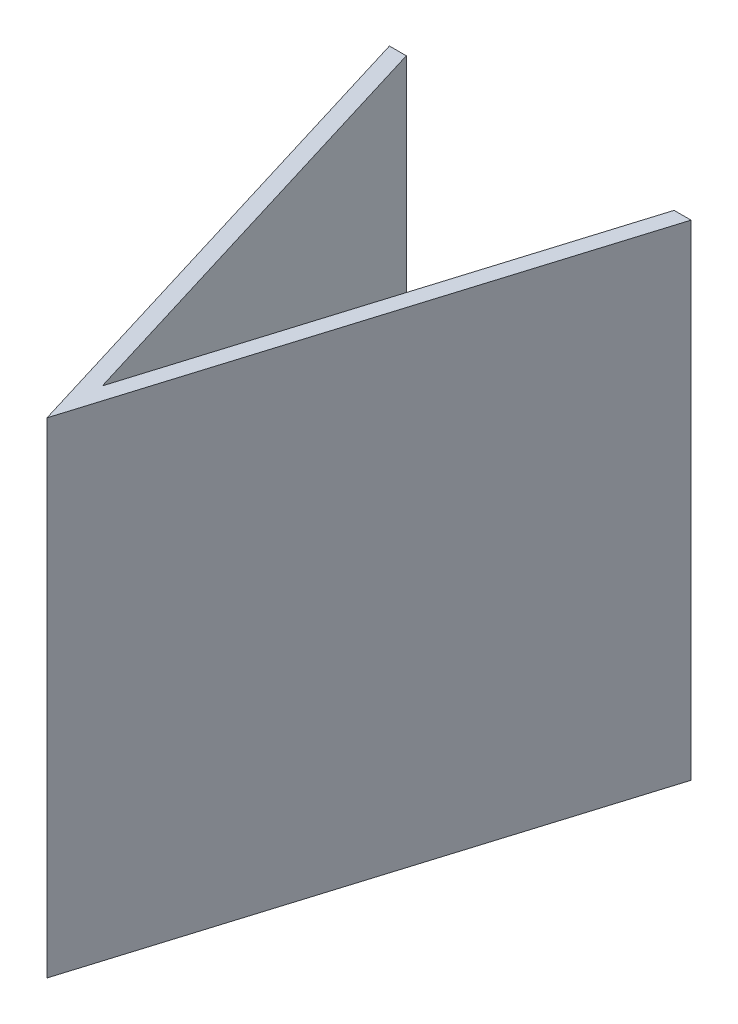
ISO-10303-21;
HEADER;
FILE_DESCRIPTION(('STEP AP214'),'2;1');
FILE_NAME('part.step','',(''),(''),'','','');
FILE_SCHEMA(('AUTOMOTIVE_DESIGN { 1 0 10303 214 1 1 1 1 }'));
ENDSEC;
DATA;
#1=APPLICATION_CONTEXT('core data for automotive mechanical design processes');
#2=APPLICATION_PROTOCOL_DEFINITION('international standard','automotive_design',2000,#1);
#3=PRODUCT_CONTEXT('',#1,'mechanical');
#4=PRODUCT('Part','Part','',(#3));
#5=PRODUCT_RELATED_PRODUCT_CATEGORY('part','',(#4));
#6=PRODUCT_DEFINITION_FORMATION('','',#4);
#7=PRODUCT_DEFINITION_CONTEXT('part definition',#1,'design');
#8=PRODUCT_DEFINITION('design','',#6,#7);
#9=PRODUCT_DEFINITION_SHAPE('','',#8);
#10=(LENGTH_UNIT() NAMED_UNIT(*) SI_UNIT(.MILLI.,.METRE.));
#11=(NAMED_UNIT(*) PLANE_ANGLE_UNIT() SI_UNIT($,.RADIAN.));
#12=(NAMED_UNIT(*) SI_UNIT($,.STERADIAN.) SOLID_ANGLE_UNIT());
#13=UNCERTAINTY_MEASURE_WITH_UNIT(LENGTH_MEASURE(1.E-05),#10,'distance_accuracy_value','');
#14=(GEOMETRIC_REPRESENTATION_CONTEXT(3) GLOBAL_UNCERTAINTY_ASSIGNED_CONTEXT((#13)) GLOBAL_UNIT_ASSIGNED_CONTEXT((#10,
#11,#12)) REPRESENTATION_CONTEXT('',''));
#15=CARTESIAN_POINT('',(0.,0.,0.));
#16=DIRECTION('',(0.,0.,1.));
#17=DIRECTION('',(1.,0.,0.));
#18=AXIS2_PLACEMENT_3D('',#15,#16,#17);
#19=CARTESIAN_POINT('',(-4.15957630186494,-2.51,4.56537000902889));
#20=DIRECTION('',(0.956304755963033,0.,-0.292371704722745));
#21=DIRECTION('',(-0.292371704722745,0.,-0.956304755963033));
#22=AXIS2_PLACEMENT_3D('',#19,#20,#21);
#23=PLANE('',#22);
#24=DIRECTION('',(0.,1.,0.));
#25=VECTOR('',#24,1.);
#26=CARTESIAN_POINT('',(-0.0200292878637983,-2.51,18.1052181991123));
#27=LINE('',#26,#25);
#28=CARTESIAN_POINT('',(-0.0200292878638,-2.5,18.1052181991123));
#29=VERTEX_POINT('',#28);
#30=CARTESIAN_POINT('',(-0.0200292878638,12.5,18.1052181991123));
#31=VERTEX_POINT('',#30);
#32=EDGE_CURVE('E11',#29,#31,#27,.T.);
#33=ORIENTED_EDGE('',*,*,#32,.F.);
#34=DIRECTION('',(-0.292371704722745,0.,-0.956304755963033));
#35=VECTOR('',#34,1.);
#36=CARTESIAN_POINT('',(-5.08047192639384,-2.5,1.55325614418803));
#37=LINE('',#36,#35);
#38=CARTESIAN_POINT('',(-4.15957630186493,-2.5,4.56537000902889));
#39=VERTEX_POINT('',#38);
#40=EDGE_CURVE('E207',#29,#39,#37,.T.);
#41=ORIENTED_EDGE('',*,*,#40,.T.);
#42=DIRECTION('',(0.,-1.,0.));
#43=VECTOR('',#42,1.);
#44=CARTESIAN_POINT('',(-4.15957630186494,-2.5,4.56537000902889));
#45=LINE('',#44,#43);
#46=CARTESIAN_POINT('',(-4.15957630186493,12.5,4.56537000902889));
#47=VERTEX_POINT('',#46);
#48=EDGE_CURVE('E198',#47,#39,#45,.T.);
#49=ORIENTED_EDGE('',*,*,#48,.F.);
#50=DIRECTION('',(-0.292371704722745,0.,-0.956304755963033));
#51=VECTOR('',#50,1.);
#52=CARTESIAN_POINT('',(-5.08047192639384,12.5,1.55325614418803));
#53=LINE('',#52,#51);
#54=EDGE_CURVE('E193',#31,#47,#53,.T.);
#55=ORIENTED_EDGE('',*,*,#54,.F.);
#56=EDGE_LOOP('',(#33,#41,#49,#55));
#57=FACE_BOUND('',#56,.T.);
#58=DIRECTION('',(-0.292371704722745,0.,-0.956304755963033));
#59=VECTOR('',#58,1.);
#60=CARTESIAN_POINT('',(-2.15999244561512,4.05,11.105714101122));
#61=LINE('',#60,#59);
#62=CARTESIAN_POINT('',(-2.63092289457158,4.05,9.56537000902889));
#63=VERTEX_POINT('',#62);
#64=CARTESIAN_POINT('',(-2.91830463710175,4.05,8.62538668396958));
#65=VERTEX_POINT('',#64);
#66=EDGE_CURVE('E219',#63,#65,#61,.T.);
#67=ORIENTED_EDGE('',*,*,#66,.T.);
#68=CARTESIAN_POINT('',(-0.0200292878638651,5.,18.1052181991121));
#69=DIRECTION('',(0.956304755963033,0.,-0.292371704722745));
#70=DIRECTION('',(-0.292371704722745,0.,-0.956304755963033));
#71=AXIS2_PLACEMENT_3D('',#68,#69,#70);
#72=ELLIPSE('',#71,10.4319260404912,3.05);
#73=CARTESIAN_POINT('',(-2.63092289457158,3.42337874730398,9.56537000902889));
#74=VERTEX_POINT('',#73);
#75=EDGE_CURVE('E213',#65,#74,#72,.F.);
#76=ORIENTED_EDGE('',*,*,#75,.T.);
#77=DIRECTION('',(0.,-1.,0.));
#78=VECTOR('',#77,1.);
#79=CARTESIAN_POINT('',(-2.63092289457158,5.,9.56537000902889));
#80=LINE('',#79,#78);
#81=EDGE_CURVE('E186',#63,#74,#80,.T.);
#82=ORIENTED_EDGE('',*,*,#81,.F.);
#83=EDGE_LOOP('',(#67,#76,#82));
#84=FACE_BOUND('',#83,.T.);
#85=DIRECTION('',(0.,-1.,0.));
#86=VECTOR('',#85,1.);
#87=CARTESIAN_POINT('',(-2.63092289457158,5.,9.56537000902889));
#88=LINE('',#87,#86);
#89=CARTESIAN_POINT('',(-2.63092289457158,6.57662125269602,9.56537000902889));
#90=VERTEX_POINT('',#89);
#91=CARTESIAN_POINT('',(-2.63092289457158,5.95,9.56537000902889));
#92=VERTEX_POINT('',#91);
#93=EDGE_CURVE('E147',#90,#92,#88,.T.);
#94=ORIENTED_EDGE('',*,*,#93,.F.);
#95=CARTESIAN_POINT('',(-0.0200292878638651,5.,18.1052181991121));
#96=DIRECTION('',(0.956304755963033,0.,-0.292371704722745));
#97=DIRECTION('',(-0.292371704722745,0.,-0.956304755963033));
#98=AXIS2_PLACEMENT_3D('',#95,#96,#97);
#99=ELLIPSE('',#98,10.4319260404912,3.05);
#100=CARTESIAN_POINT('',(-2.91830463710175,5.95,8.62538668396958));
#101=VERTEX_POINT('',#100);
#102=EDGE_CURVE('E138',#90,#101,#99,.F.);
#103=ORIENTED_EDGE('',*,*,#102,.T.);
#104=DIRECTION('',(0.292371704722745,0.,0.956304755963033));
#105=VECTOR('',#104,1.);
#106=CARTESIAN_POINT('',(-2.15999244561512,5.95,11.105714101122));
#107=LINE('',#106,#105);
#108=EDGE_CURVE('E146',#101,#92,#107,.T.);
#109=ORIENTED_EDGE('',*,*,#108,.T.);
#110=EDGE_LOOP('',(#94,#103,#109));
#111=FACE_BOUND('',#110,.T.);
#112=ADVANCED_FACE('F32',(#57,#84,#111),#23,.T.);
#113=CARTESIAN_POINT('',(-0.0200292878637983,-2.51,18.1052181991123));
#114=DIRECTION('',(-0.956304755963035,0.,-0.292371704722737));
#115=DIRECTION('',(-0.292371704722737,0.,0.956304755963036));
#116=AXIS2_PLACEMENT_3D('',#113,#114,#115);
#117=PLANE('',#116);
#118=DIRECTION('',(0.,1.,0.));
#119=VECTOR('',#118,1.);
#120=CARTESIAN_POINT('',(4.1195177261372,-2.5,4.56537000902889));
#121=LINE('',#120,#119);
#122=CARTESIAN_POINT('',(4.1195177261372,-2.5,4.56537000902889));
#123=VERTEX_POINT('',#122);
#124=CARTESIAN_POINT('',(4.1195177261372,12.5,4.56537000902889));
#125=VERTEX_POINT('',#124);
#126=EDGE_CURVE('E201',#123,#125,#121,.T.);
#127=ORIENTED_EDGE('',*,*,#126,.F.);
#128=DIRECTION('',(-0.292371704722737,0.,0.956304755963036));
#129=VECTOR('',#128,1.);
#130=CARTESIAN_POINT('',(5.04383760633929,-2.5,1.54205590855293));
#131=LINE('',#130,#129);
#132=EDGE_CURVE('E204',#123,#29,#131,.T.);
#133=ORIENTED_EDGE('',*,*,#132,.T.);
#134=ORIENTED_EDGE('',*,*,#32,.T.);
#135=DIRECTION('',(-0.292371704722737,0.,0.956304755963036));
#136=VECTOR('',#135,1.);
#137=CARTESIAN_POINT('',(5.04383760633929,12.5,1.54205590855293));
#138=LINE('',#137,#136);
#139=EDGE_CURVE('E195',#125,#31,#138,.T.);
#140=ORIENTED_EDGE('',*,*,#139,.F.);
#141=EDGE_LOOP('',(#127,#133,#134,#140));
#142=FACE_BOUND('',#141,.T.);
#143=DIRECTION('',(0.,1.,0.));
#144=VECTOR('',#143,1.);
#145=CARTESIAN_POINT('',(2.5908643188439,5.,9.56537000902889));
#146=LINE('',#145,#144);
#147=CARTESIAN_POINT('',(2.5908643188439,3.42337874730406,9.56537000902889));
#148=VERTEX_POINT('',#147);
#149=CARTESIAN_POINT('',(2.5908643188439,4.05,9.56537000902889));
#150=VERTEX_POINT('',#149);
#151=EDGE_CURVE('E191',#148,#150,#146,.T.);
#152=ORIENTED_EDGE('',*,*,#151,.F.);
#153=CARTESIAN_POINT('',(-0.0200292878638651,5.,18.1052181991125));
#154=DIRECTION('',(-0.956304755963035,0.,-0.292371704722737));
#155=DIRECTION('',(0.292371704722737,0.,-0.956304755963036));
#156=AXIS2_PLACEMENT_3D('',#153,#154,#155);
#157=ELLIPSE('',#156,10.4319260404915,3.05);
#158=CARTESIAN_POINT('',(2.87824606137402,4.05,8.62538668396971));
#159=VERTEX_POINT('',#158);
#160=EDGE_CURVE('E210',#148,#159,#157,.F.);
#161=ORIENTED_EDGE('',*,*,#160,.T.);
#162=DIRECTION('',(-0.292371704722737,0.,0.956304755963036));
#163=VECTOR('',#162,1.);
#164=CARTESIAN_POINT('',(2.61543005899706,4.05,9.48501909352394));
#165=LINE('',#164,#163);
#166=EDGE_CURVE('E216',#159,#150,#165,.T.);
#167=ORIENTED_EDGE('',*,*,#166,.T.);
#168=EDGE_LOOP('',(#152,#161,#167));
#169=FACE_BOUND('',#168,.T.);
#170=DIRECTION('',(0.292371704722737,0.,-0.956304755963036));
#171=VECTOR('',#170,1.);
#172=CARTESIAN_POINT('',(2.61543005899706,5.95,9.48501909352394));
#173=LINE('',#172,#171);
#174=CARTESIAN_POINT('',(2.5908643188439,5.95,9.56537000902889));
#175=VERTEX_POINT('',#174);
#176=CARTESIAN_POINT('',(2.87824606137402,5.95,8.62538668396971));
#177=VERTEX_POINT('',#176);
#178=EDGE_CURVE('E149',#175,#177,#173,.T.);
#179=ORIENTED_EDGE('',*,*,#178,.T.);
#180=CARTESIAN_POINT('',(-0.0200292878638651,5.,18.1052181991125));
#181=DIRECTION('',(-0.956304755963035,0.,-0.292371704722737));
#182=DIRECTION('',(0.292371704722737,0.,-0.956304755963036));
#183=AXIS2_PLACEMENT_3D('',#180,#181,#182);
#184=ELLIPSE('',#183,10.4319260404915,3.05);
#185=CARTESIAN_POINT('',(2.5908643188439,6.57662125269594,9.56537000902889));
#186=VERTEX_POINT('',#185);
#187=EDGE_CURVE('E148',#177,#186,#184,.F.);
#188=ORIENTED_EDGE('',*,*,#187,.T.);
#189=DIRECTION('',(0.,1.,0.));
#190=VECTOR('',#189,1.);
#191=CARTESIAN_POINT('',(2.5908643188439,5.,9.56537000902889));
#192=LINE('',#191,#190);
#193=EDGE_CURVE('E181',#175,#186,#192,.T.);
#194=ORIENTED_EDGE('',*,*,#193,.F.);
#195=EDGE_LOOP('',(#179,#188,#194));
#196=FACE_BOUND('',#195,.T.);
#197=ADVANCED_FACE('F225',(#142,#169,#196),#117,.T.);
#198=CARTESIAN_POINT('',(2.87824606137402,5.95,9.56537000902889));
#199=DIRECTION('',(0.,-1.,0.));
#200=DIRECTION('',(0.,0.,-1.));
#201=AXIS2_PLACEMENT_3D('',#198,#199,#200);
#202=PLANE('',#201);
#203=ORIENTED_EDGE('',*,*,#108,.F.);
#204=DIRECTION('',(0.,0.,-1.));
#205=VECTOR('',#204,1.);
#206=CARTESIAN_POINT('',(-2.91830463710175,5.95,9.56537000902889));
#207=LINE('',#206,#205);
#208=CARTESIAN_POINT('',(-2.91830463710175,5.95,9.56537000902889));
#209=VERTEX_POINT('',#208);
#210=EDGE_CURVE('E135',#209,#101,#207,.T.);
#211=ORIENTED_EDGE('',*,*,#210,.F.);
#212=DIRECTION('',(-1.,0.,0.));
#213=VECTOR('',#212,1.);
#214=CARTESIAN_POINT('',(2.87824606137402,5.95,9.56537000902889));
#215=LINE('',#214,#213);
#216=EDGE_CURVE('E56',#92,#209,#215,.T.);
#217=ORIENTED_EDGE('',*,*,#216,.F.);
#218=EDGE_LOOP('',(#203,#211,#217));
#219=FACE_BOUND('',#218,.T.);
#220=ADVANCED_FACE('F151',(#219),#202,.F.);
#221=CARTESIAN_POINT('',(-0.0200292878638651,5.,9.56537000902889));
#222=DIRECTION('',(0.,0.,-1.));
#223=DIRECTION('',(-1.,0.,0.));
#224=AXIS2_PLACEMENT_3D('',#221,#222,#223);
#225=CYLINDRICAL_SURFACE('',#224,3.05);
#226=ORIENTED_EDGE('',*,*,#102,.F.);
#227=CARTESIAN_POINT('',(-0.0200292878638651,5.,9.56537000902889));
#228=DIRECTION('',(0.,0.,-1.));
#229=DIRECTION('',(-1.,0.,0.));
#230=AXIS2_PLACEMENT_3D('',#227,#228,#229);
#231=CIRCLE('',#230,3.05);
#232=EDGE_CURVE('E36',#209,#90,#231,.T.);
#233=ORIENTED_EDGE('',*,*,#232,.F.);
#234=ORIENTED_EDGE('',*,*,#210,.T.);
#235=EDGE_LOOP('',(#226,#233,#234));
#236=FACE_BOUND('',#235,.T.);
#237=ADVANCED_FACE('F137',(#236),#225,.F.);
#238=CARTESIAN_POINT('',(-0.0200292878638651,5.,9.56537000902889));
#239=DIRECTION('',(0.,0.,-1.));
#240=DIRECTION('',(-1.,0.,0.));
#241=AXIS2_PLACEMENT_3D('',#238,#239,#240);
#242=PLANE('',#241);
#243=ORIENTED_EDGE('',*,*,#232,.T.);
#244=ORIENTED_EDGE('',*,*,#93,.T.);
#245=ORIENTED_EDGE('',*,*,#216,.T.);
#246=EDGE_LOOP('',(#243,#244,#245));
#247=FACE_BOUND('',#246,.T.);
#248=ADVANCED_FACE('F179',(#247),#242,.T.);
#249=ORIENTED_EDGE('',*,*,#187,.F.);
#250=DIRECTION('',(0.,0.,-1.));
#251=VECTOR('',#250,1.);
#252=CARTESIAN_POINT('',(2.87824606137402,5.95,9.56537000902889));
#253=LINE('',#252,#251);
#254=CARTESIAN_POINT('',(2.87824606137402,5.95,9.56537000902889));
#255=VERTEX_POINT('',#254);
#256=EDGE_CURVE('E141',#255,#177,#253,.T.);
#257=ORIENTED_EDGE('',*,*,#256,.F.);
#258=EDGE_CURVE('E41',#186,#255,#231,.T.);
#259=ORIENTED_EDGE('',*,*,#258,.F.);
#260=EDGE_LOOP('',(#249,#257,#259));
#261=FACE_BOUND('',#260,.T.);
#262=ADVANCED_FACE('F228',(#261),#225,.F.);
#263=ORIENTED_EDGE('',*,*,#178,.F.);
#264=EDGE_CURVE('E177',#255,#175,#215,.T.);
#265=ORIENTED_EDGE('',*,*,#264,.F.);
#266=ORIENTED_EDGE('',*,*,#256,.T.);
#267=EDGE_LOOP('',(#263,#265,#266));
#268=FACE_BOUND('',#267,.T.);
#269=ADVANCED_FACE('F230',(#268),#202,.F.);
#270=ORIENTED_EDGE('',*,*,#264,.T.);
#271=ORIENTED_EDGE('',*,*,#193,.T.);
#272=ORIENTED_EDGE('',*,*,#258,.T.);
#273=EDGE_LOOP('',(#270,#271,#272));
#274=FACE_BOUND('',#273,.T.);
#275=ADVANCED_FACE('F232',(#274),#242,.T.);
#276=CARTESIAN_POINT('',(-0.0200292878638651,5.,9.56537000902889));
#277=DIRECTION('',(0.,0.,-1.));
#278=DIRECTION('',(-1.,0.,0.));
#279=AXIS2_PLACEMENT_3D('',#276,#277,#278);
#280=CYLINDRICAL_SURFACE('',#279,3.05);
#281=ORIENTED_EDGE('',*,*,#75,.F.);
#282=DIRECTION('',(0.,0.,-1.));
#283=VECTOR('',#282,1.);
#284=CARTESIAN_POINT('',(-2.91830463710175,4.05,9.56537000902889));
#285=LINE('',#284,#283);
#286=CARTESIAN_POINT('',(-2.91830463710175,4.05,9.56537000902889));
#287=VERTEX_POINT('',#286);
#288=EDGE_CURVE('E167',#287,#65,#285,.T.);
#289=ORIENTED_EDGE('',*,*,#288,.F.);
#290=CARTESIAN_POINT('',(-0.0200292878638651,5.,9.56537000902889));
#291=DIRECTION('',(0.,0.,-1.));
#292=DIRECTION('',(-1.,0.,0.));
#293=AXIS2_PLACEMENT_3D('',#290,#291,#292);
#294=CIRCLE('',#293,3.05);
#295=EDGE_CURVE('E142',#74,#287,#294,.T.);
#296=ORIENTED_EDGE('',*,*,#295,.F.);
#297=EDGE_LOOP('',(#281,#289,#296));
#298=FACE_BOUND('',#297,.T.);
#299=ADVANCED_FACE('F238',(#298),#280,.F.);
#300=CARTESIAN_POINT('',(2.87824606137402,4.05,9.56537000902889));
#301=DIRECTION('',(0.,1.,0.));
#302=DIRECTION('',(0.,0.,1.));
#303=AXIS2_PLACEMENT_3D('',#300,#301,#302);
#304=PLANE('',#303);
#305=ORIENTED_EDGE('',*,*,#66,.F.);
#306=DIRECTION('',(1.,0.,0.));
#307=VECTOR('',#306,1.);
#308=CARTESIAN_POINT('',(2.87824606137402,4.05,9.56537000902889));
#309=LINE('',#308,#307);
#310=EDGE_CURVE('E170',#287,#63,#309,.T.);
#311=ORIENTED_EDGE('',*,*,#310,.F.);
#312=ORIENTED_EDGE('',*,*,#288,.T.);
#313=EDGE_LOOP('',(#305,#311,#312));
#314=FACE_BOUND('',#313,.T.);
#315=ADVANCED_FACE('F300',(#314),#304,.F.);
#316=CARTESIAN_POINT('',(-0.0200292878638651,5.,9.56537000902889));
#317=DIRECTION('',(0.,0.,-1.));
#318=DIRECTION('',(-1.,0.,0.));
#319=AXIS2_PLACEMENT_3D('',#316,#317,#318);
#320=PLANE('',#319);
#321=ORIENTED_EDGE('',*,*,#310,.T.);
#322=ORIENTED_EDGE('',*,*,#81,.T.);
#323=ORIENTED_EDGE('',*,*,#295,.T.);
#324=EDGE_LOOP('',(#321,#322,#323));
#325=FACE_BOUND('',#324,.T.);
#326=ADVANCED_FACE('F303',(#325),#320,.T.);
#327=ORIENTED_EDGE('',*,*,#166,.F.);
#328=DIRECTION('',(0.,0.,-1.));
#329=VECTOR('',#328,1.);
#330=CARTESIAN_POINT('',(2.87824606137402,4.05,9.56537000902889));
#331=LINE('',#330,#329);
#332=CARTESIAN_POINT('',(2.87824606137402,4.05,9.56537000902889));
#333=VERTEX_POINT('',#332);
#334=EDGE_CURVE('E165',#333,#159,#331,.T.);
#335=ORIENTED_EDGE('',*,*,#334,.F.);
#336=EDGE_CURVE('E173',#150,#333,#309,.T.);
#337=ORIENTED_EDGE('',*,*,#336,.F.);
#338=EDGE_LOOP('',(#327,#335,#337));
#339=FACE_BOUND('',#338,.T.);
#340=ADVANCED_FACE('F312',(#339),#304,.F.);
#341=ORIENTED_EDGE('',*,*,#160,.F.);
#342=EDGE_CURVE('E174',#333,#148,#294,.T.);
#343=ORIENTED_EDGE('',*,*,#342,.F.);
#344=ORIENTED_EDGE('',*,*,#334,.T.);
#345=EDGE_LOOP('',(#341,#343,#344));
#346=FACE_BOUND('',#345,.T.);
#347=ADVANCED_FACE('F307',(#346),#280,.F.);
#348=ORIENTED_EDGE('',*,*,#342,.T.);
#349=ORIENTED_EDGE('',*,*,#151,.T.);
#350=ORIENTED_EDGE('',*,*,#336,.T.);
#351=EDGE_LOOP('',(#348,#349,#350));
#352=FACE_BOUND('',#351,.T.);
#353=ADVANCED_FACE('F315',(#352),#320,.T.);
#354=CARTESIAN_POINT('',(0.,12.5,0.));
#355=DIRECTION('',(0.,1.,0.));
#356=DIRECTION('',(0.,0.,1.));
#357=AXIS2_PLACEMENT_3D('',#354,#355,#356);
#358=PLANE('',#357);
#359=DIRECTION('',(-1.,0.,0.));
#360=VECTOR('',#359,1.);
#361=CARTESIAN_POINT('',(4.64236360438078,12.5,4.56537000902889));
#362=LINE('',#361,#360);
#363=CARTESIAN_POINT('',(4.64236360438078,12.5,4.56537000902889));
#364=VERTEX_POINT('',#363);
#365=EDGE_CURVE('E160',#364,#125,#362,.T.);
#366=ORIENTED_EDGE('',*,*,#365,.T.);
#367=ORIENTED_EDGE('',*,*,#139,.T.);
#368=ORIENTED_EDGE('',*,*,#54,.T.);
#369=CARTESIAN_POINT('',(-4.68242218010851,12.5,4.56537000902889));
#370=VERTEX_POINT('',#369);
#371=EDGE_CURVE('E163',#47,#370,#362,.T.);
#372=ORIENTED_EDGE('',*,*,#371,.T.);
#373=DIRECTION('',(0.292371704722747,0.,0.956304755963032));
#374=VECTOR('',#373,1.);
#375=CARTESIAN_POINT('',(-0.0200292878637907,12.5,19.8153700090289));
#376=LINE('',#375,#374);
#377=CARTESIAN_POINT('',(-0.0200292878637907,12.5,19.8153700090289));
#378=VERTEX_POINT('',#377);
#379=EDGE_CURVE('E168',#370,#378,#376,.T.);
#380=ORIENTED_EDGE('',*,*,#379,.T.);
#381=DIRECTION('',(0.292371704722737,0.,-0.956304755963035));
#382=VECTOR('',#381,1.);
#383=CARTESIAN_POINT('',(0.973595426876858,12.5,16.5653700090289));
#384=LINE('',#383,#382);
#385=EDGE_CURVE('E278',#378,#364,#384,.T.);
#386=ORIENTED_EDGE('',*,*,#385,.T.);
#387=EDGE_LOOP('',(#366,#367,#368,#372,#380,#386));
#388=FACE_BOUND('',#387,.T.);
#389=ADVANCED_FACE('F275',(#388),#358,.T.);
#390=CARTESIAN_POINT('',(4.64236360438078,-2.5,4.56537000902889));
#391=DIRECTION('',(0.,0.,-1.));
#392=DIRECTION('',(-1.,0.,0.));
#393=AXIS2_PLACEMENT_3D('',#390,#391,#392);
#394=PLANE('',#393);
#395=DIRECTION('',(-1.,0.,0.));
#396=VECTOR('',#395,1.);
#397=CARTESIAN_POINT('',(4.64236360438078,-2.5,4.56537000902889));
#398=LINE('',#397,#396);
#399=CARTESIAN_POINT('',(4.64236360438078,-2.5,4.56537000902889));
#400=VERTEX_POINT('',#399);
#401=EDGE_CURVE('E156',#400,#123,#398,.T.);
#402=ORIENTED_EDGE('',*,*,#401,.T.);
#403=ORIENTED_EDGE('',*,*,#126,.T.);
#404=ORIENTED_EDGE('',*,*,#365,.F.);
#405=DIRECTION('',(0.,1.,0.));
#406=VECTOR('',#405,1.);
#407=CARTESIAN_POINT('',(4.64236360438078,-2.5,4.56537000902889));
#408=LINE('',#407,#406);
#409=EDGE_CURVE('E184',#400,#364,#408,.T.);
#410=ORIENTED_EDGE('',*,*,#409,.F.);
#411=EDGE_LOOP('',(#402,#403,#404,#410));
#412=FACE_BOUND('',#411,.T.);
#413=ADVANCED_FACE('F264',(#412),#394,.T.);
#414=CARTESIAN_POINT('',(0.973595426876858,-2.5,16.5653700090289));
#415=DIRECTION('',(0.956304755963036,0.,0.292371704722736));
#416=DIRECTION('',(0.292371704722736,0.,-0.956304755963036));
#417=AXIS2_PLACEMENT_3D('',#414,#415,#416);
#418=PLANE('',#417);
#419=ORIENTED_EDGE('',*,*,#409,.T.);
#420=ORIENTED_EDGE('',*,*,#385,.F.);
#421=DIRECTION('',(0.,1.,0.));
#422=VECTOR('',#421,1.);
#423=CARTESIAN_POINT('',(-0.0200292878637907,-2.5,19.8153700090289));
#424=LINE('',#423,#422);
#425=CARTESIAN_POINT('',(-0.0200292878637907,-2.5,19.8153700090289));
#426=VERTEX_POINT('',#425);
#427=EDGE_CURVE('E159',#426,#378,#424,.T.);
#428=ORIENTED_EDGE('',*,*,#427,.F.);
#429=DIRECTION('',(0.292371704722737,0.,-0.956304755963035));
#430=VECTOR('',#429,1.);
#431=CARTESIAN_POINT('',(0.973595426876858,-2.5,16.5653700090289));
#432=LINE('',#431,#430);
#433=EDGE_CURVE('E285',#426,#400,#432,.T.);
#434=ORIENTED_EDGE('',*,*,#433,.T.);
#435=EDGE_LOOP('',(#419,#420,#428,#434));
#436=FACE_BOUND('',#435,.T.);
#437=ADVANCED_FACE('F291',(#436),#418,.T.);
#438=CARTESIAN_POINT('',(-1.01365400260447,-2.5,16.5653700090289));
#439=DIRECTION('',(-0.956304755963033,0.,0.292371704722745));
#440=DIRECTION('',(0.292371704722745,0.,0.956304755963033));
#441=AXIS2_PLACEMENT_3D('',#438,#439,#440);
#442=PLANE('',#441);
#443=ORIENTED_EDGE('',*,*,#427,.T.);
#444=ORIENTED_EDGE('',*,*,#379,.F.);
#445=DIRECTION('',(0.,1.,0.));
#446=VECTOR('',#445,1.);
#447=CARTESIAN_POINT('',(-4.68242218010851,-2.5,4.56537000902889));
#448=LINE('',#447,#446);
#449=CARTESIAN_POINT('',(-4.68242218010851,-2.5,4.56537000902889));
#450=VERTEX_POINT('',#449);
#451=EDGE_CURVE('E180',#450,#370,#448,.T.);
#452=ORIENTED_EDGE('',*,*,#451,.F.);
#453=DIRECTION('',(0.292371704722747,0.,0.956304755963032));
#454=VECTOR('',#453,1.);
#455=CARTESIAN_POINT('',(-0.0200292878637907,-2.5,19.8153700090289));
#456=LINE('',#455,#454);
#457=EDGE_CURVE('E164',#450,#426,#456,.T.);
#458=ORIENTED_EDGE('',*,*,#457,.T.);
#459=EDGE_LOOP('',(#443,#444,#452,#458));
#460=FACE_BOUND('',#459,.T.);
#461=ADVANCED_FACE('F262',(#460),#442,.T.);
#462=ORIENTED_EDGE('',*,*,#371,.F.);
#463=ORIENTED_EDGE('',*,*,#48,.T.);
#464=EDGE_CURVE('E158',#39,#450,#398,.T.);
#465=ORIENTED_EDGE('',*,*,#464,.T.);
#466=ORIENTED_EDGE('',*,*,#451,.T.);
#467=EDGE_LOOP('',(#462,#463,#465,#466));
#468=FACE_BOUND('',#467,.T.);
#469=ADVANCED_FACE('F257',(#468),#394,.T.);
#470=CARTESIAN_POINT('',(0.,-2.5,0.));
#471=DIRECTION('',(0.,1.,0.));
#472=DIRECTION('',(0.,0.,1.));
#473=AXIS2_PLACEMENT_3D('',#470,#471,#472);
#474=PLANE('',#473);
#475=ORIENTED_EDGE('',*,*,#132,.F.);
#476=ORIENTED_EDGE('',*,*,#401,.F.);
#477=ORIENTED_EDGE('',*,*,#433,.F.);
#478=ORIENTED_EDGE('',*,*,#457,.F.);
#479=ORIENTED_EDGE('',*,*,#464,.F.);
#480=ORIENTED_EDGE('',*,*,#40,.F.);
#481=EDGE_LOOP('',(#475,#476,#477,#478,#479,#480));
#482=FACE_BOUND('',#481,.T.);
#483=ADVANCED_FACE('F34',(#482),#474,.F.);
#484=CLOSED_SHELL('',(#112,#197,#220,#237,#248,#262,#269,#275,#299,#315,#326,#340,#347,#353,
#389,#413,#437,#461,#469,#483));
#485=MANIFOLD_SOLID_BREP('B2',#484);
#486=ADVANCED_BREP_SHAPE_REPRESENTATION('',(#18,#485),#14);
#487=SHAPE_DEFINITION_REPRESENTATION(#9,#486);
ENDSEC;
END-ISO-10303-21;
